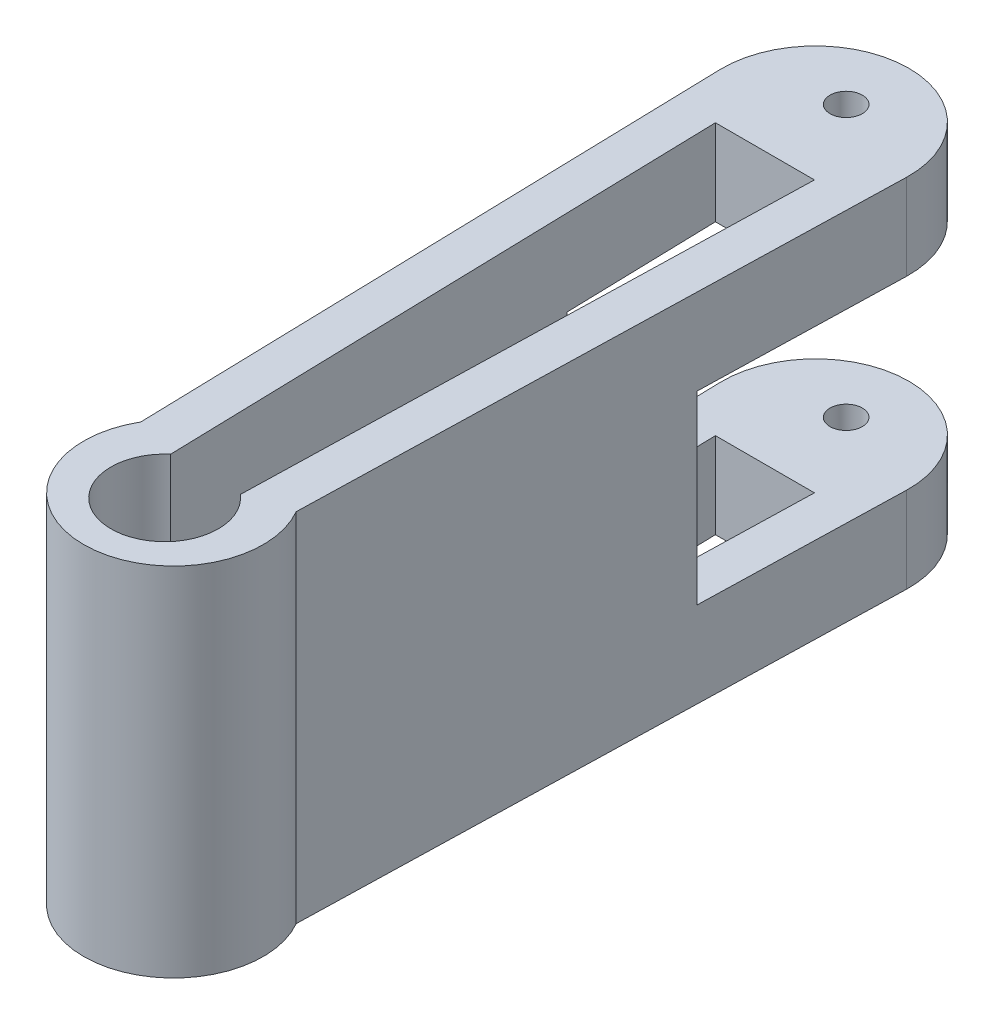
ISO-10303-21;
HEADER;
FILE_DESCRIPTION(('STEP AP214'),'2;1');
FILE_NAME('part.step','',(''),(''),'','','');
FILE_SCHEMA(('AUTOMOTIVE_DESIGN { 1 0 10303 214 1 1 1 1 }'));
ENDSEC;
DATA;
#1=APPLICATION_CONTEXT('core data for automotive mechanical design processes');
#2=APPLICATION_PROTOCOL_DEFINITION('international standard','automotive_design',2000,#1);
#3=PRODUCT_CONTEXT('',#1,'mechanical');
#4=PRODUCT('Part','Part','',(#3));
#5=PRODUCT_RELATED_PRODUCT_CATEGORY('part','',(#4));
#6=PRODUCT_DEFINITION_FORMATION('','',#4);
#7=PRODUCT_DEFINITION_CONTEXT('part definition',#1,'design');
#8=PRODUCT_DEFINITION('design','',#6,#7);
#9=PRODUCT_DEFINITION_SHAPE('','',#8);
#10=(LENGTH_UNIT() NAMED_UNIT(*) SI_UNIT(.MILLI.,.METRE.));
#11=(NAMED_UNIT(*) PLANE_ANGLE_UNIT() SI_UNIT($,.RADIAN.));
#12=(NAMED_UNIT(*) SI_UNIT($,.STERADIAN.) SOLID_ANGLE_UNIT());
#13=UNCERTAINTY_MEASURE_WITH_UNIT(LENGTH_MEASURE(1.E-05),#10,'distance_accuracy_value','');
#14=(GEOMETRIC_REPRESENTATION_CONTEXT(3) GLOBAL_UNCERTAINTY_ASSIGNED_CONTEXT((#13)) GLOBAL_UNIT_ASSIGNED_CONTEXT((#10,
#11,#12)) REPRESENTATION_CONTEXT('',''));
#15=CARTESIAN_POINT('',(0.,0.,0.));
#16=DIRECTION('',(0.,0.,1.));
#17=DIRECTION('',(1.,0.,0.));
#18=AXIS2_PLACEMENT_3D('',#15,#16,#17);
#19=CARTESIAN_POINT('',(-15.1043803137539,12.827,30.1512816002045));
#20=DIRECTION('',(-0.0261769483078731,0.,0.999657324975557));
#21=DIRECTION('',(0.999657324975557,0.,0.0261769483078731));
#22=AXIS2_PLACEMENT_3D('',#19,#20,#21);
#23=PLANE('',#22);
#24=DIRECTION('',(0.999657324975557,0.,0.0261769483078731));
#25=VECTOR('',#24,1.);
#26=CARTESIAN_POINT('',(-15.1043803137539,40.513,30.1512816002045));
#27=LINE('',#26,#25);
#28=CARTESIAN_POINT('',(-13.1634709791378,40.513,30.2021060998137));
#29=VERTEX_POINT('',#28);
#30=CARTESIAN_POINT('',(-6.80693555466247,40.513,30.3685578378907));
#31=VERTEX_POINT('',#30);
#32=EDGE_CURVE('E216',#29,#31,#27,.T.);
#33=ORIENTED_EDGE('',*,*,#32,.T.);
#34=DIRECTION('',(0.,-1.,0.));
#35=VECTOR('',#34,1.);
#36=CARTESIAN_POINT('',(-6.80693555466247,12.827,30.3685578378907));
#37=LINE('',#36,#35);
#38=CARTESIAN_POINT('',(-6.80693555466247,12.827,30.3685578378907));
#39=VERTEX_POINT('',#38);
#40=EDGE_CURVE('E199',#31,#39,#37,.T.);
#41=ORIENTED_EDGE('',*,*,#40,.T.);
#42=DIRECTION('',(0.999657324975557,0.,0.0261769483078731));
#43=VECTOR('',#42,1.);
#44=CARTESIAN_POINT('',(-15.1043803137539,12.827,30.1512816002045));
#45=LINE('',#44,#43);
#46=CARTESIAN_POINT('',(-13.1634709791378,12.827,30.2021060998137));
#47=VERTEX_POINT('',#46);
#48=EDGE_CURVE('E211',#47,#39,#45,.T.);
#49=ORIENTED_EDGE('',*,*,#48,.F.);
#50=DIRECTION('',(0.,-1.,0.));
#51=VECTOR('',#50,1.);
#52=CARTESIAN_POINT('',(-13.1634709791378,53.34,30.2021060998137));
#53=LINE('',#52,#51);
#54=EDGE_CURVE('E224',#29,#47,#53,.T.);
#55=ORIENTED_EDGE('',*,*,#54,.F.);
#56=EDGE_LOOP('',(#33,#41,#49,#55));
#57=FACE_BOUND('',#56,.T.);
#58=ADVANCED_FACE('F33',(#57),#23,.F.);
#59=CARTESIAN_POINT('',(0.,53.34,0.));
#60=DIRECTION('',(0.,-1.,0.));
#61=DIRECTION('',(0.,0.,-1.));
#62=AXIS2_PLACEMENT_3D('',#59,#60,#61);
#63=CYLINDRICAL_SURFACE('',#62,13.949559156562);
#64=DIRECTION('',(0.,-1.,0.));
#65=VECTOR('',#64,1.);
#66=CARTESIAN_POINT('',(-13.9447789910371,53.34,0.36515688895895));
#67=LINE('',#66,#65);
#68=CARTESIAN_POINT('',(-13.9447789910371,12.827,0.36515688895895));
#69=VERTEX_POINT('',#68);
#70=CARTESIAN_POINT('',(-13.9447789910371,0.,0.36515688895895));
#71=VERTEX_POINT('',#70);
#72=EDGE_CURVE('E263',#69,#71,#67,.T.);
#73=ORIENTED_EDGE('',*,*,#72,.F.);
#74=CARTESIAN_POINT('',(0.,12.827,0.));
#75=DIRECTION('',(0.,-1.,0.));
#76=DIRECTION('',(0.,0.,-1.));
#77=AXIS2_PLACEMENT_3D('',#74,#75,#76);
#78=CIRCLE('',#77,13.949559156562);
#79=CARTESIAN_POINT('',(13.9447789910371,12.827,0.365156888958943));
#80=VERTEX_POINT('',#79);
#81=EDGE_CURVE('E230',#69,#80,#78,.T.);
#82=ORIENTED_EDGE('',*,*,#81,.T.);
#83=DIRECTION('',(0.,-1.,0.));
#84=VECTOR('',#83,1.);
#85=CARTESIAN_POINT('',(13.9447789910371,53.34,0.365156888958942));
#86=LINE('',#85,#84);
#87=CARTESIAN_POINT('',(13.9447789910371,0.,0.365156888958942));
#88=VERTEX_POINT('',#87);
#89=EDGE_CURVE('E245',#80,#88,#86,.T.);
#90=ORIENTED_EDGE('',*,*,#89,.T.);
#91=CARTESIAN_POINT('',(0.,0.,0.));
#92=DIRECTION('',(0.,1.,0.));
#93=DIRECTION('',(0.,0.,1.));
#94=AXIS2_PLACEMENT_3D('',#91,#92,#93);
#95=CIRCLE('',#94,13.949559156562);
#96=EDGE_CURVE('E233',#88,#71,#95,.T.);
#97=ORIENTED_EDGE('',*,*,#96,.T.);
#98=EDGE_LOOP('',(#73,#82,#90,#97));
#99=FACE_BOUND('',#98,.T.);
#100=ADVANCED_FACE('F295',(#99),#63,.T.);
#101=CARTESIAN_POINT('',(13.9447789910371,53.34,0.365156888958942));
#102=VERTEX_POINT('',#101);
#103=CARTESIAN_POINT('',(13.9447789910371,40.513,0.365156888958942));
#104=VERTEX_POINT('',#103);
#105=EDGE_CURVE('E255',#102,#104,#86,.T.);
#106=ORIENTED_EDGE('',*,*,#105,.T.);
#107=CARTESIAN_POINT('',(0.,40.513,0.));
#108=DIRECTION('',(0.,1.,0.));
#109=DIRECTION('',(0.,0.,1.));
#110=AXIS2_PLACEMENT_3D('',#107,#108,#109);
#111=CIRCLE('',#110,13.949559156562);
#112=CARTESIAN_POINT('',(-13.9447789910371,40.513,0.36515688895895));
#113=VERTEX_POINT('',#112);
#114=EDGE_CURVE('E221',#104,#113,#111,.T.);
#115=ORIENTED_EDGE('',*,*,#114,.T.);
#116=CARTESIAN_POINT('',(-13.9447789910371,53.34,0.36515688895895));
#117=VERTEX_POINT('',#116);
#118=EDGE_CURVE('E264',#117,#113,#67,.T.);
#119=ORIENTED_EDGE('',*,*,#118,.F.);
#120=CARTESIAN_POINT('',(0.,53.34,0.));
#121=DIRECTION('',(0.,1.,0.));
#122=DIRECTION('',(0.,0.,1.));
#123=AXIS2_PLACEMENT_3D('',#120,#121,#122);
#124=CIRCLE('',#123,13.949559156562);
#125=EDGE_CURVE('E234',#102,#117,#124,.T.);
#126=ORIENTED_EDGE('',*,*,#125,.F.);
#127=EDGE_LOOP('',(#106,#115,#119,#126));
#128=FACE_BOUND('',#127,.T.);
#129=ADVANCED_FACE('F35',(#128),#63,.T.);
#130=CARTESIAN_POINT('',(-13.9447789910371,53.34,0.36515688895895));
#131=DIRECTION('',(0.999657324975557,0.,-0.0261769483078737));
#132=DIRECTION('',(-0.0261769483078737,0.,-0.999657324975557));
#133=AXIS2_PLACEMENT_3D('',#130,#131,#132);
#134=PLANE('',#133);
#135=ORIENTED_EDGE('',*,*,#54,.T.);
#136=DIRECTION('',(-0.0261769483078737,0.,-0.999657324975557));
#137=VECTOR('',#136,1.);
#138=CARTESIAN_POINT('',(-13.9447789910371,12.827,0.36515688895895));
#139=LINE('',#138,#137);
#140=EDGE_CURVE('E227',#47,#69,#139,.T.);
#141=ORIENTED_EDGE('',*,*,#140,.T.);
#142=ORIENTED_EDGE('',*,*,#72,.T.);
#143=DIRECTION('',(0.0261769483078737,0.,0.999657324975557));
#144=VECTOR('',#143,1.);
#145=CARTESIAN_POINT('',(-13.9447789910371,0.,0.36515688895895));
#146=LINE('',#145,#144);
#147=CARTESIAN_POINT('',(-11.6168505635363,0.,89.2651568889589));
#148=VERTEX_POINT('',#147);
#149=EDGE_CURVE('E248',#71,#148,#146,.T.);
#150=ORIENTED_EDGE('',*,*,#149,.T.);
#151=DIRECTION('',(0.,-1.,0.));
#152=VECTOR('',#151,1.);
#153=CARTESIAN_POINT('',(-11.6168505635363,53.34,89.2651568889589));
#154=LINE('',#153,#152);
#155=CARTESIAN_POINT('',(-11.6168505635363,53.34,89.2651568889589));
#156=VERTEX_POINT('',#155);
#157=EDGE_CURVE('E260',#156,#148,#154,.T.);
#158=ORIENTED_EDGE('',*,*,#157,.F.);
#159=DIRECTION('',(0.0261769483078737,0.,0.999657324975557));
#160=VECTOR('',#159,1.);
#161=CARTESIAN_POINT('',(-13.9447789910371,53.34,0.36515688895895));
#162=LINE('',#161,#160);
#163=EDGE_CURVE('E237',#117,#156,#162,.T.);
#164=ORIENTED_EDGE('',*,*,#163,.F.);
#165=ORIENTED_EDGE('',*,*,#118,.T.);
#166=DIRECTION('',(0.0261769483078737,0.,0.999657324975557));
#167=VECTOR('',#166,1.);
#168=CARTESIAN_POINT('',(-13.9447789910371,40.513,0.36515688895895));
#169=LINE('',#168,#167);
#170=EDGE_CURVE('E214',#113,#29,#169,.T.);
#171=ORIENTED_EDGE('',*,*,#170,.T.);
#172=EDGE_LOOP('',(#135,#141,#142,#150,#158,#164,#165,#171));
#173=FACE_BOUND('',#172,.T.);
#174=ADVANCED_FACE('F292',(#173),#134,.F.);
#175=CARTESIAN_POINT('',(0.,53.34,95.9894545405975));
#176=DIRECTION('',(0.,-1.,0.));
#177=DIRECTION('',(0.,0.,-1.));
#178=AXIS2_PLACEMENT_3D('',#175,#176,#177);
#179=CYLINDRICAL_SURFACE('',#178,13.4226448929921);
#180=CARTESIAN_POINT('',(0.,0.,95.9894545405975));
#181=DIRECTION('',(0.,1.,0.));
#182=DIRECTION('',(0.,0.,1.));
#183=AXIS2_PLACEMENT_3D('',#180,#181,#182);
#184=CIRCLE('',#183,13.4226448929921);
#185=CARTESIAN_POINT('',(11.6168505635364,0.,89.2651568889589));
#186=VERTEX_POINT('',#185);
#187=EDGE_CURVE('E250',#148,#186,#184,.T.);
#188=ORIENTED_EDGE('',*,*,#187,.T.);
#189=DIRECTION('',(0.,-1.,0.));
#190=VECTOR('',#189,1.);
#191=CARTESIAN_POINT('',(11.6168505635364,53.34,89.2651568889589));
#192=LINE('',#191,#190);
#193=CARTESIAN_POINT('',(11.6168505635364,53.34,89.2651568889589));
#194=VERTEX_POINT('',#193);
#195=EDGE_CURVE('E258',#194,#186,#192,.T.);
#196=ORIENTED_EDGE('',*,*,#195,.F.);
#197=CARTESIAN_POINT('',(0.,53.34,95.9894545405975));
#198=DIRECTION('',(0.,1.,0.));
#199=DIRECTION('',(0.,0.,1.));
#200=AXIS2_PLACEMENT_3D('',#197,#198,#199);
#201=CIRCLE('',#200,13.4226448929921);
#202=EDGE_CURVE('E240',#156,#194,#201,.T.);
#203=ORIENTED_EDGE('',*,*,#202,.F.);
#204=ORIENTED_EDGE('',*,*,#157,.T.);
#205=EDGE_LOOP('',(#188,#196,#203,#204));
#206=FACE_BOUND('',#205,.T.);
#207=ADVANCED_FACE('F307',(#206),#179,.T.);
#208=CARTESIAN_POINT('',(13.9447789910371,53.34,0.365156888958942));
#209=DIRECTION('',(0.999657324975557,0.,0.0261769483078731));
#210=DIRECTION('',(0.0261769483078731,0.,-0.999657324975557));
#211=AXIS2_PLACEMENT_3D('',#208,#209,#210);
#212=PLANE('',#211);
#213=DIRECTION('',(0.0261769483078731,0.,-0.999657324975557));
#214=VECTOR('',#213,1.);
#215=CARTESIAN_POINT('',(13.1454308996518,12.827,30.8910289409831));
#216=LINE('',#215,#214);
#217=CARTESIAN_POINT('',(13.1454308996518,12.827,30.8910289409831));
#218=VERTEX_POINT('',#217);
#219=EDGE_CURVE('E208',#218,#80,#216,.T.);
#220=ORIENTED_EDGE('',*,*,#219,.F.);
#221=DIRECTION('',(0.,-1.,0.));
#222=VECTOR('',#221,1.);
#223=CARTESIAN_POINT('',(13.1454308996518,12.827,30.8910289409831));
#224=LINE('',#223,#222);
#225=CARTESIAN_POINT('',(13.1454308996518,40.513,30.8910289409831));
#226=VERTEX_POINT('',#225);
#227=EDGE_CURVE('E205',#226,#218,#224,.T.);
#228=ORIENTED_EDGE('',*,*,#227,.F.);
#229=DIRECTION('',(-0.0261769483078731,0.,0.999657324975557));
#230=VECTOR('',#229,1.);
#231=CARTESIAN_POINT('',(13.9447789910371,40.513,0.365156888958942));
#232=LINE('',#231,#230);
#233=EDGE_CURVE('E267',#104,#226,#232,.T.);
#234=ORIENTED_EDGE('',*,*,#233,.F.);
#235=ORIENTED_EDGE('',*,*,#105,.F.);
#236=DIRECTION('',(-0.0261769483078731,0.,0.999657324975557));
#237=VECTOR('',#236,1.);
#238=CARTESIAN_POINT('',(13.9447789910371,53.34,0.365156888958942));
#239=LINE('',#238,#237);
#240=EDGE_CURVE('E242',#102,#194,#239,.T.);
#241=ORIENTED_EDGE('',*,*,#240,.T.);
#242=ORIENTED_EDGE('',*,*,#195,.T.);
#243=DIRECTION('',(-0.0261769483078731,0.,0.999657324975557));
#244=VECTOR('',#243,1.);
#245=CARTESIAN_POINT('',(13.9447789910371,0.,0.365156888958942));
#246=LINE('',#245,#244);
#247=EDGE_CURVE('E238',#88,#186,#246,.T.);
#248=ORIENTED_EDGE('',*,*,#247,.F.);
#249=ORIENTED_EDGE('',*,*,#89,.F.);
#250=EDGE_LOOP('',(#220,#228,#234,#235,#241,#242,#248,#249));
#251=FACE_BOUND('',#250,.T.);
#252=ADVANCED_FACE('F302',(#251),#212,.T.);
#253=CARTESIAN_POINT('',(0.,53.34,0.));
#254=DIRECTION('',(0.,1.,0.));
#255=DIRECTION('',(0.,0.,1.));
#256=AXIS2_PLACEMENT_3D('',#253,#254,#255);
#257=PLANE('',#256);
#258=CARTESIAN_POINT('',(0.,53.34,-4.57874024016128));
#259=DIRECTION('',(0.,1.,0.));
#260=DIRECTION('',(0.,0.,1.));
#261=AXIS2_PLACEMENT_3D('',#258,#259,#260);
#262=CIRCLE('',#261,2.413);
#263=CARTESIAN_POINT('',(0.,53.34,-2.16574024016128));
#264=VERTEX_POINT('',#263);
#265=EDGE_CURVE('E468',#264,#264,#262,.T.);
#266=ORIENTED_EDGE('',*,*,#265,.F.);
#267=EDGE_LOOP('',(#266));
#268=FACE_BOUND('',#267,.T.);
#269=CARTESIAN_POINT('',(0.,53.34,97.3127171435874));
#270=DIRECTION('',(0.,1.,0.));
#271=DIRECTION('',(0.,0.,1.));
#272=AXIS2_PLACEMENT_3D('',#269,#270,#271);
#273=CIRCLE('',#272,8.02628130689801);
#274=CARTESIAN_POINT('',(-5.21373558662709,53.34,91.2104099692313));
#275=VERTEX_POINT('',#274);
#276=CARTESIAN_POINT('',(5.21373558662713,53.34,91.2104099692313));
#277=VERTEX_POINT('',#276);
#278=EDGE_CURVE('E49',#275,#277,#273,.T.);
#279=ORIENTED_EDGE('',*,*,#278,.F.);
#280=DIRECTION('',(0.0261769483078736,0.,0.999657324975557));
#281=VECTOR('',#280,1.);
#282=CARTESIAN_POINT('',(-5.21373558662709,53.34,91.2104099692313));
#283=LINE('',#282,#281);
#284=CARTESIAN_POINT('',(-7.40397755307151,53.34,7.5684437830325));
#285=VERTEX_POINT('',#284);
#286=EDGE_CURVE('E167',#285,#275,#283,.T.);
#287=ORIENTED_EDGE('',*,*,#286,.F.);
#288=DIRECTION('',(-1.,0.,0.));
#289=VECTOR('',#288,1.);
#290=CARTESIAN_POINT('',(7.40397755307151,53.34,7.5684437830325));
#291=LINE('',#290,#289);
#292=CARTESIAN_POINT('',(7.40397755307151,53.34,7.5684437830325));
#293=VERTEX_POINT('',#292);
#294=EDGE_CURVE('E170',#293,#285,#291,.T.);
#295=ORIENTED_EDGE('',*,*,#294,.F.);
#296=DIRECTION('',(0.0261769483078731,0.,-0.999657324975557));
#297=VECTOR('',#296,1.);
#298=CARTESIAN_POINT('',(7.40397755307151,53.34,7.5684437830325));
#299=LINE('',#298,#297);
#300=EDGE_CURVE('E179',#277,#293,#299,.T.);
#301=ORIENTED_EDGE('',*,*,#300,.F.);
#302=EDGE_LOOP('',(#279,#287,#295,#301));
#303=FACE_BOUND('',#302,.T.);
#304=ORIENTED_EDGE('',*,*,#125,.T.);
#305=ORIENTED_EDGE('',*,*,#163,.T.);
#306=ORIENTED_EDGE('',*,*,#202,.T.);
#307=ORIENTED_EDGE('',*,*,#240,.F.);
#308=EDGE_LOOP('',(#304,#305,#306,#307));
#309=FACE_BOUND('',#308,.T.);
#310=ADVANCED_FACE('F312',(#268,#303,#309),#257,.T.);
#311=CARTESIAN_POINT('',(0.,0.,0.));
#312=DIRECTION('',(0.,1.,0.));
#313=DIRECTION('',(0.,0.,1.));
#314=AXIS2_PLACEMENT_3D('',#311,#312,#313);
#315=PLANE('',#314);
#316=CARTESIAN_POINT('',(0.,0.,-4.57874024016128));
#317=DIRECTION('',(0.,1.,0.));
#318=DIRECTION('',(0.,0.,1.));
#319=AXIS2_PLACEMENT_3D('',#316,#317,#318);
#320=CIRCLE('',#319,2.413);
#321=CARTESIAN_POINT('',(0.,0.,-2.16574024016128));
#322=VERTEX_POINT('',#321);
#323=EDGE_CURVE('E469',#322,#322,#320,.T.);
#324=ORIENTED_EDGE('',*,*,#323,.T.);
#325=EDGE_LOOP('',(#324));
#326=FACE_BOUND('',#325,.T.);
#327=DIRECTION('',(0.0261769483078736,0.,0.999657324975557));
#328=VECTOR('',#327,1.);
#329=CARTESIAN_POINT('',(-5.21373558662709,0.,91.2104099692313));
#330=LINE('',#329,#328);
#331=CARTESIAN_POINT('',(-7.40397755307151,0.,7.5684437830325));
#332=VERTEX_POINT('',#331);
#333=CARTESIAN_POINT('',(-5.21373558662709,0.,91.2104099692313));
#334=VERTEX_POINT('',#333);
#335=EDGE_CURVE('E156',#332,#334,#330,.T.);
#336=ORIENTED_EDGE('',*,*,#335,.T.);
#337=CARTESIAN_POINT('',(0.,0.,97.3127171435874));
#338=DIRECTION('',(0.,1.,0.));
#339=DIRECTION('',(0.,0.,1.));
#340=AXIS2_PLACEMENT_3D('',#337,#338,#339);
#341=CIRCLE('',#340,8.02628130689801);
#342=CARTESIAN_POINT('',(5.21373558662713,0.,91.2104099692313));
#343=VERTEX_POINT('',#342);
#344=EDGE_CURVE('E150',#334,#343,#341,.T.);
#345=ORIENTED_EDGE('',*,*,#344,.T.);
#346=DIRECTION('',(0.0261769483078731,0.,-0.999657324975557));
#347=VECTOR('',#346,1.);
#348=CARTESIAN_POINT('',(7.40397755307151,0.,7.5684437830325));
#349=LINE('',#348,#347);
#350=CARTESIAN_POINT('',(7.40397755307151,0.,7.5684437830325));
#351=VERTEX_POINT('',#350);
#352=EDGE_CURVE('E159',#343,#351,#349,.T.);
#353=ORIENTED_EDGE('',*,*,#352,.T.);
#354=DIRECTION('',(-1.,0.,0.));
#355=VECTOR('',#354,1.);
#356=CARTESIAN_POINT('',(7.40397755307151,0.,7.5684437830325));
#357=LINE('',#356,#355);
#358=EDGE_CURVE('E57',#351,#332,#357,.T.);
#359=ORIENTED_EDGE('',*,*,#358,.T.);
#360=EDGE_LOOP('',(#336,#345,#353,#359));
#361=FACE_BOUND('',#360,.T.);
#362=ORIENTED_EDGE('',*,*,#96,.F.);
#363=ORIENTED_EDGE('',*,*,#247,.T.);
#364=ORIENTED_EDGE('',*,*,#187,.F.);
#365=ORIENTED_EDGE('',*,*,#149,.F.);
#366=EDGE_LOOP('',(#362,#363,#364,#365));
#367=FACE_BOUND('',#366,.T.);
#368=ADVANCED_FACE('F164',(#326,#361,#367),#315,.F.);
#369=CARTESIAN_POINT('',(-15.1043803137539,12.827,30.1512816002045));
#370=DIRECTION('',(0.,-1.,0.));
#371=DIRECTION('',(0.,0.,-1.));
#372=AXIS2_PLACEMENT_3D('',#369,#370,#371);
#373=PLANE('',#372);
#374=CARTESIAN_POINT('',(0.,12.827,-4.57874024016128));
#375=DIRECTION('',(0.,-1.,0.));
#376=DIRECTION('',(0.,0.,-1.));
#377=AXIS2_PLACEMENT_3D('',#374,#375,#376);
#378=CIRCLE('',#377,2.413);
#379=CARTESIAN_POINT('',(0.,12.827,-6.99174024016128));
#380=VERTEX_POINT('',#379);
#381=EDGE_CURVE('E173',#380,#380,#378,.T.);
#382=ORIENTED_EDGE('',*,*,#381,.T.);
#383=EDGE_LOOP('',(#382));
#384=FACE_BOUND('',#383,.T.);
#385=ORIENTED_EDGE('',*,*,#48,.T.);
#386=DIRECTION('',(-0.0261769483078736,0.,-0.999657324975557));
#387=VECTOR('',#386,1.);
#388=CARTESIAN_POINT('',(-6.81830691433065,12.827,29.9343031320507));
#389=LINE('',#388,#387);
#390=CARTESIAN_POINT('',(-7.40397755307151,12.827,7.5684437830325));
#391=VERTEX_POINT('',#390);
#392=EDGE_CURVE('E202',#39,#391,#389,.T.);
#393=ORIENTED_EDGE('',*,*,#392,.T.);
#394=DIRECTION('',(1.,0.,0.));
#395=VECTOR('',#394,1.);
#396=CARTESIAN_POINT('',(-15.1043803137539,12.827,7.56844378303249));
#397=LINE('',#396,#395);
#398=CARTESIAN_POINT('',(7.40397755307151,12.827,7.5684437830325));
#399=VERTEX_POINT('',#398);
#400=EDGE_CURVE('E196',#391,#399,#397,.T.);
#401=ORIENTED_EDGE('',*,*,#400,.T.);
#402=DIRECTION('',(-0.0261769483078731,0.,0.999657324975557));
#403=VECTOR('',#402,1.);
#404=CARTESIAN_POINT('',(6.79760688605696,12.827,30.7248053192281));
#405=LINE('',#404,#403);
#406=CARTESIAN_POINT('',(6.79760688605696,12.827,30.7248053192281));
#407=VERTEX_POINT('',#406);
#408=EDGE_CURVE('E193',#399,#407,#405,.T.);
#409=ORIENTED_EDGE('',*,*,#408,.T.);
#410=EDGE_CURVE('E215',#407,#218,#45,.T.);
#411=ORIENTED_EDGE('',*,*,#410,.T.);
#412=ORIENTED_EDGE('',*,*,#219,.T.);
#413=ORIENTED_EDGE('',*,*,#81,.F.);
#414=ORIENTED_EDGE('',*,*,#140,.F.);
#415=EDGE_LOOP('',(#385,#393,#401,#409,#411,#412,#413,#414));
#416=FACE_BOUND('',#415,.T.);
#417=ADVANCED_FACE('F289',(#384,#416),#373,.F.);
#418=ORIENTED_EDGE('',*,*,#410,.F.);
#419=DIRECTION('',(0.,1.,0.));
#420=VECTOR('',#419,1.);
#421=CARTESIAN_POINT('',(6.79760688605696,12.827,30.7248053192281));
#422=LINE('',#421,#420);
#423=CARTESIAN_POINT('',(6.79760688605696,40.513,30.7248053192281));
#424=VERTEX_POINT('',#423);
#425=EDGE_CURVE('E185',#407,#424,#422,.T.);
#426=ORIENTED_EDGE('',*,*,#425,.T.);
#427=EDGE_CURVE('E210',#424,#226,#27,.T.);
#428=ORIENTED_EDGE('',*,*,#427,.T.);
#429=ORIENTED_EDGE('',*,*,#227,.T.);
#430=EDGE_LOOP('',(#418,#426,#428,#429));
#431=FACE_BOUND('',#430,.T.);
#432=ADVANCED_FACE('F318',(#431),#23,.F.);
#433=CARTESIAN_POINT('',(-15.1043803137539,40.513,30.1512816002045));
#434=DIRECTION('',(0.,1.,0.));
#435=DIRECTION('',(0.,0.,1.));
#436=AXIS2_PLACEMENT_3D('',#433,#434,#435);
#437=PLANE('',#436);
#438=CARTESIAN_POINT('',(0.,40.513,-4.57874024016128));
#439=DIRECTION('',(0.,1.,0.));
#440=DIRECTION('',(0.,0.,1.));
#441=AXIS2_PLACEMENT_3D('',#438,#439,#440);
#442=CIRCLE('',#441,2.413);
#443=CARTESIAN_POINT('',(0.,40.513,-2.16574024016128));
#444=VERTEX_POINT('',#443);
#445=EDGE_CURVE('E37',#444,#444,#442,.T.);
#446=ORIENTED_EDGE('',*,*,#445,.T.);
#447=EDGE_LOOP('',(#446));
#448=FACE_BOUND('',#447,.T.);
#449=DIRECTION('',(-1.,0.,0.));
#450=VECTOR('',#449,1.);
#451=CARTESIAN_POINT('',(-15.1043803137539,40.513,7.56844378303249));
#452=LINE('',#451,#450);
#453=CARTESIAN_POINT('',(7.40397755307152,40.513,7.5684437830325));
#454=VERTEX_POINT('',#453);
#455=CARTESIAN_POINT('',(-7.40397755307151,40.513,7.5684437830325));
#456=VERTEX_POINT('',#455);
#457=EDGE_CURVE('E42',#454,#456,#452,.T.);
#458=ORIENTED_EDGE('',*,*,#457,.T.);
#459=DIRECTION('',(0.0261769483078736,0.,0.999657324975557));
#460=VECTOR('',#459,1.);
#461=CARTESIAN_POINT('',(-6.81830691433065,40.513,29.9343031320507));
#462=LINE('',#461,#460);
#463=EDGE_CURVE('E12',#456,#31,#462,.T.);
#464=ORIENTED_EDGE('',*,*,#463,.T.);
#465=ORIENTED_EDGE('',*,*,#32,.F.);
#466=ORIENTED_EDGE('',*,*,#170,.F.);
#467=ORIENTED_EDGE('',*,*,#114,.F.);
#468=ORIENTED_EDGE('',*,*,#233,.T.);
#469=ORIENTED_EDGE('',*,*,#427,.F.);
#470=DIRECTION('',(0.0261769483078731,0.,-0.999657324975557));
#471=VECTOR('',#470,1.);
#472=CARTESIAN_POINT('',(6.79760688605696,40.513,30.7248053192281));
#473=LINE('',#472,#471);
#474=EDGE_CURVE('E270',#424,#454,#473,.T.);
#475=ORIENTED_EDGE('',*,*,#474,.T.);
#476=EDGE_LOOP('',(#458,#464,#465,#466,#467,#468,#469,#475));
#477=FACE_BOUND('',#476,.T.);
#478=ADVANCED_FACE('F276',(#448,#477),#437,.F.);
#479=CARTESIAN_POINT('',(-5.21373558662709,0.,91.2104099692313));
#480=DIRECTION('',(-0.999657324975557,0.,0.0261769483078736));
#481=DIRECTION('',(0.0261769483078736,0.,0.999657324975557));
#482=AXIS2_PLACEMENT_3D('',#479,#480,#481);
#483=PLANE('',#482);
#484=ORIENTED_EDGE('',*,*,#40,.F.);
#485=ORIENTED_EDGE('',*,*,#463,.F.);
#486=DIRECTION('',(0.,1.,0.));
#487=VECTOR('',#486,1.);
#488=CARTESIAN_POINT('',(-7.40397755307151,0.,7.5684437830325));
#489=LINE('',#488,#487);
#490=EDGE_CURVE('E189',#456,#285,#489,.T.);
#491=ORIENTED_EDGE('',*,*,#490,.T.);
#492=ORIENTED_EDGE('',*,*,#286,.T.);
#493=DIRECTION('',(0.,1.,0.));
#494=VECTOR('',#493,1.);
#495=CARTESIAN_POINT('',(-5.21373558662709,0.,91.2104099692313));
#496=LINE('',#495,#494);
#497=EDGE_CURVE('E183',#334,#275,#496,.T.);
#498=ORIENTED_EDGE('',*,*,#497,.F.);
#499=ORIENTED_EDGE('',*,*,#335,.F.);
#500=EDGE_CURVE('E186',#332,#391,#489,.T.);
#501=ORIENTED_EDGE('',*,*,#500,.T.);
#502=ORIENTED_EDGE('',*,*,#392,.F.);
#503=EDGE_LOOP('',(#484,#485,#491,#492,#498,#499,#501,#502));
#504=FACE_BOUND('',#503,.T.);
#505=ADVANCED_FACE('F285',(#504),#483,.F.);
#506=CARTESIAN_POINT('',(7.40397755307151,0.,7.5684437830325));
#507=DIRECTION('',(0.,0.,-1.));
#508=DIRECTION('',(-1.,0.,0.));
#509=AXIS2_PLACEMENT_3D('',#506,#507,#508);
#510=PLANE('',#509);
#511=ORIENTED_EDGE('',*,*,#500,.F.);
#512=ORIENTED_EDGE('',*,*,#358,.F.);
#513=DIRECTION('',(0.,1.,0.));
#514=VECTOR('',#513,1.);
#515=CARTESIAN_POINT('',(7.40397755307151,0.,7.5684437830325));
#516=LINE('',#515,#514);
#517=EDGE_CURVE('E161',#351,#399,#516,.T.);
#518=ORIENTED_EDGE('',*,*,#517,.T.);
#519=ORIENTED_EDGE('',*,*,#400,.F.);
#520=EDGE_LOOP('',(#511,#512,#518,#519));
#521=FACE_BOUND('',#520,.T.);
#522=ADVANCED_FACE('F319',(#521),#510,.F.);
#523=EDGE_CURVE('E155',#454,#293,#516,.T.);
#524=ORIENTED_EDGE('',*,*,#523,.T.);
#525=ORIENTED_EDGE('',*,*,#294,.T.);
#526=ORIENTED_EDGE('',*,*,#490,.F.);
#527=ORIENTED_EDGE('',*,*,#457,.F.);
#528=EDGE_LOOP('',(#524,#525,#526,#527));
#529=FACE_BOUND('',#528,.T.);
#530=ADVANCED_FACE('F281',(#529),#510,.F.);
#531=CARTESIAN_POINT('',(7.40397755307151,0.,7.5684437830325));
#532=DIRECTION('',(0.999657324975557,0.,0.0261769483078731));
#533=DIRECTION('',(0.0261769483078731,0.,-0.999657324975557));
#534=AXIS2_PLACEMENT_3D('',#531,#532,#533);
#535=PLANE('',#534);
#536=ORIENTED_EDGE('',*,*,#517,.F.);
#537=ORIENTED_EDGE('',*,*,#352,.F.);
#538=DIRECTION('',(0.,1.,0.));
#539=VECTOR('',#538,1.);
#540=CARTESIAN_POINT('',(5.21373558662713,0.,91.2104099692313));
#541=LINE('',#540,#539);
#542=EDGE_CURVE('E146',#343,#277,#541,.T.);
#543=ORIENTED_EDGE('',*,*,#542,.T.);
#544=ORIENTED_EDGE('',*,*,#300,.T.);
#545=ORIENTED_EDGE('',*,*,#523,.F.);
#546=ORIENTED_EDGE('',*,*,#474,.F.);
#547=ORIENTED_EDGE('',*,*,#425,.F.);
#548=ORIENTED_EDGE('',*,*,#408,.F.);
#549=EDGE_LOOP('',(#536,#537,#543,#544,#545,#546,#547,#548));
#550=FACE_BOUND('',#549,.T.);
#551=ADVANCED_FACE('F160',(#550),#535,.F.);
#552=CARTESIAN_POINT('',(0.,0.,97.3127171435874));
#553=DIRECTION('',(0.,1.,0.));
#554=DIRECTION('',(0.,0.,1.));
#555=AXIS2_PLACEMENT_3D('',#552,#553,#554);
#556=CYLINDRICAL_SURFACE('',#555,8.02628130689801);
#557=ORIENTED_EDGE('',*,*,#278,.T.);
#558=ORIENTED_EDGE('',*,*,#542,.F.);
#559=ORIENTED_EDGE('',*,*,#344,.F.);
#560=ORIENTED_EDGE('',*,*,#497,.T.);
#561=EDGE_LOOP('',(#557,#558,#559,#560));
#562=FACE_BOUND('',#561,.T.);
#563=ADVANCED_FACE('F148',(#562),#556,.F.);
#564=CARTESIAN_POINT('',(0.,0.,-4.57874024016128));
#565=DIRECTION('',(0.,1.,0.));
#566=DIRECTION('',(0.,0.,1.));
#567=AXIS2_PLACEMENT_3D('',#564,#565,#566);
#568=CYLINDRICAL_SURFACE('',#567,2.413);
#569=ORIENTED_EDGE('',*,*,#265,.T.);
#570=EDGE_LOOP('',(#569));
#571=FACE_BOUND('',#570,.T.);
#572=ORIENTED_EDGE('',*,*,#445,.F.);
#573=EDGE_LOOP('',(#572));
#574=FACE_BOUND('',#573,.T.);
#575=ADVANCED_FACE('F350',(#571,#574),#568,.F.);
#576=ORIENTED_EDGE('',*,*,#323,.F.);
#577=EDGE_LOOP('',(#576));
#578=FACE_BOUND('',#577,.T.);
#579=ORIENTED_EDGE('',*,*,#381,.F.);
#580=EDGE_LOOP('',(#579));
#581=FACE_BOUND('',#580,.T.);
#582=ADVANCED_FACE('F367',(#578,#581),#568,.F.);
#583=CLOSED_SHELL('',(#58,#100,#129,#174,#207,#252,#310,#368,#417,#432,#478,#505,#522,#530,#551,
#563,#575,#582));
#584=MANIFOLD_SOLID_BREP('B2',#583);
#585=ADVANCED_BREP_SHAPE_REPRESENTATION('',(#18,#584),#14);
#586=SHAPE_DEFINITION_REPRESENTATION(#9,#585);
ENDSEC;
END-ISO-10303-21;
